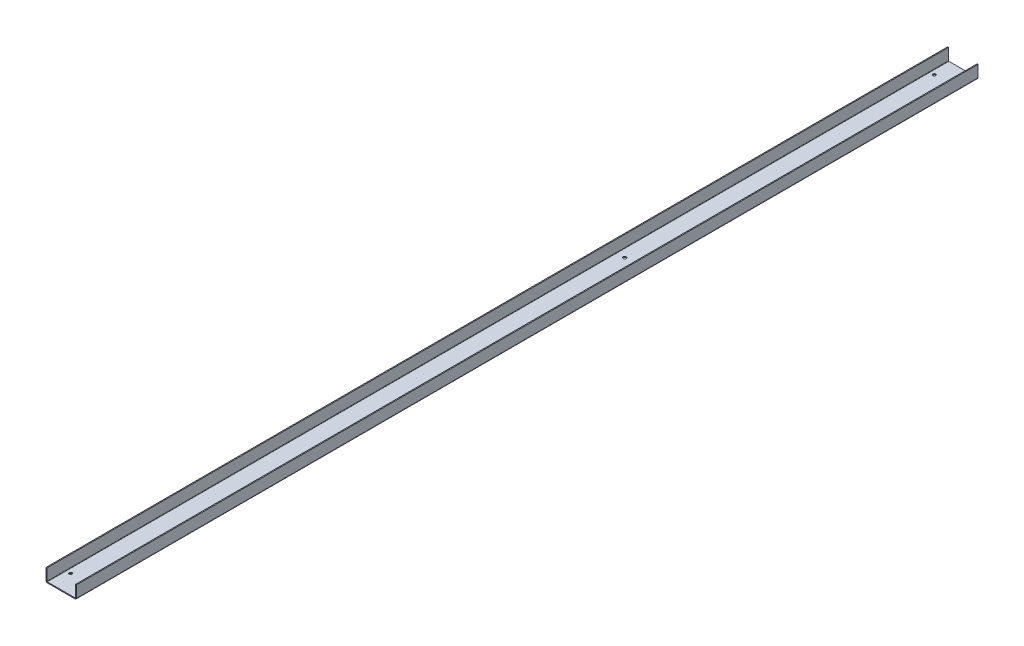
ISO-10303-21;
HEADER;
FILE_DESCRIPTION(('STEP AP214'),'2;1');
FILE_NAME('part.step','',(''),(''),'','','');
FILE_SCHEMA(('AUTOMOTIVE_DESIGN { 1 0 10303 214 1 1 1 1 }'));
ENDSEC;
DATA;
#1=APPLICATION_CONTEXT('core data for automotive mechanical design processes');
#2=APPLICATION_PROTOCOL_DEFINITION('international standard','automotive_design',2000,#1);
#3=PRODUCT_CONTEXT('',#1,'mechanical');
#4=PRODUCT('Part','Part','',(#3));
#5=PRODUCT_RELATED_PRODUCT_CATEGORY('part','',(#4));
#6=PRODUCT_DEFINITION_FORMATION('','',#4);
#7=PRODUCT_DEFINITION_CONTEXT('part definition',#1,'design');
#8=PRODUCT_DEFINITION('design','',#6,#7);
#9=PRODUCT_DEFINITION_SHAPE('','',#8);
#10=(LENGTH_UNIT() NAMED_UNIT(*) SI_UNIT(.MILLI.,.METRE.));
#11=(NAMED_UNIT(*) PLANE_ANGLE_UNIT() SI_UNIT($,.RADIAN.));
#12=(NAMED_UNIT(*) SI_UNIT($,.STERADIAN.) SOLID_ANGLE_UNIT());
#13=UNCERTAINTY_MEASURE_WITH_UNIT(LENGTH_MEASURE(1.E-05),#10,'distance_accuracy_value','');
#14=(GEOMETRIC_REPRESENTATION_CONTEXT(3) GLOBAL_UNCERTAINTY_ASSIGNED_CONTEXT((#13)) GLOBAL_UNIT_ASSIGNED_CONTEXT((#10,
#11,#12)) REPRESENTATION_CONTEXT('',''));
#15=CARTESIAN_POINT('',(0.,0.,0.));
#16=DIRECTION('',(0.,0.,1.));
#17=DIRECTION('',(1.,0.,0.));
#18=AXIS2_PLACEMENT_3D('',#15,#16,#17);
#19=CARTESIAN_POINT('',(-29.2634,0.,950.));
#20=DIRECTION('',(0.,0.,1.));
#21=DIRECTION('',(1.,0.,0.));
#22=AXIS2_PLACEMENT_3D('',#19,#20,#21);
#23=PLANE('',#22);
#24=DIRECTION('',(0.,-1.,0.));
#25=VECTOR('',#24,1.);
#26=CARTESIAN_POINT('',(-29.2634,0.,950.));
#27=LINE('',#26,#25);
#28=CARTESIAN_POINT('',(-29.2634,0.,950.));
#29=VERTEX_POINT('',#28);
#30=CARTESIAN_POINT('',(-29.2634,-2.,950.));
#31=VERTEX_POINT('',#30);
#32=EDGE_CURVE('E11',#29,#31,#27,.T.);
#33=ORIENTED_EDGE('',*,*,#32,.F.);
#34=CARTESIAN_POINT('',(-29.2634,0.7366,950.));
#35=DIRECTION('',(0.,0.,-1.));
#36=DIRECTION('',(-1.,0.,0.));
#37=AXIS2_PLACEMENT_3D('',#34,#35,#36);
#38=CIRCLE('',#37,0.7366);
#39=CARTESIAN_POINT('',(-30.,0.7366,950.));
#40=VERTEX_POINT('',#39);
#41=EDGE_CURVE('E252',#40,#29,#38,.F.);
#42=ORIENTED_EDGE('',*,*,#41,.F.);
#43=DIRECTION('',(1.,0.,0.));
#44=VECTOR('',#43,1.);
#45=CARTESIAN_POINT('',(-32.,0.736600000000001,950.));
#46=LINE('',#45,#44);
#47=CARTESIAN_POINT('',(-32.,0.736600000000001,950.));
#48=VERTEX_POINT('',#47);
#49=EDGE_CURVE('E49',#48,#40,#46,.T.);
#50=ORIENTED_EDGE('',*,*,#49,.F.);
#51=CARTESIAN_POINT('',(-29.2634,0.7366,950.));
#52=DIRECTION('',(0.,0.,1.));
#53=DIRECTION('',(1.,0.,0.));
#54=AXIS2_PLACEMENT_3D('',#51,#52,#53);
#55=CIRCLE('',#54,2.7366);
#56=EDGE_CURVE('E150',#48,#31,#55,.T.);
#57=ORIENTED_EDGE('',*,*,#56,.T.);
#58=EDGE_LOOP('',(#33,#42,#50,#57));
#59=FACE_BOUND('',#58,.T.);
#60=ADVANCED_FACE('F41',(#59),#23,.T.);
#61=CARTESIAN_POINT('',(-32.,0.736600000000001,950.));
#62=DIRECTION('',(0.,0.,1.));
#63=DIRECTION('',(1.,0.,0.));
#64=AXIS2_PLACEMENT_3D('',#61,#62,#63);
#65=PLANE('',#64);
#66=DIRECTION('',(1.,0.,0.));
#67=VECTOR('',#66,1.);
#68=CARTESIAN_POINT('',(-30.,0.,950.));
#69=LINE('',#68,#67);
#70=CARTESIAN_POINT('',(29.2634,0.,950.));
#71=VERTEX_POINT('',#70);
#72=EDGE_CURVE('E144',#29,#71,#69,.T.);
#73=ORIENTED_EDGE('',*,*,#72,.F.);
#74=ORIENTED_EDGE('',*,*,#32,.T.);
#75=DIRECTION('',(1.,0.,0.));
#76=VECTOR('',#75,1.);
#77=CARTESIAN_POINT('',(-30.,-2.,950.));
#78=LINE('',#77,#76);
#79=CARTESIAN_POINT('',(29.2634,-1.99999999999999,950.));
#80=VERTEX_POINT('',#79);
#81=EDGE_CURVE('E141',#31,#80,#78,.T.);
#82=ORIENTED_EDGE('',*,*,#81,.T.);
#83=DIRECTION('',(0.,1.,0.));
#84=VECTOR('',#83,1.);
#85=CARTESIAN_POINT('',(29.2634,-1.99999999999999,950.));
#86=LINE('',#85,#84);
#87=EDGE_CURVE('E233',#80,#71,#86,.T.);
#88=ORIENTED_EDGE('',*,*,#87,.T.);
#89=EDGE_LOOP('',(#73,#74,#82,#88));
#90=FACE_BOUND('',#89,.T.);
#91=ADVANCED_FACE('F139',(#90),#65,.T.);
#92=CARTESIAN_POINT('',(-30.,0.7366,-950.));
#93=DIRECTION('',(0.,0.,-1.));
#94=DIRECTION('',(-1.,0.,0.));
#95=AXIS2_PLACEMENT_3D('',#92,#93,#94);
#96=PLANE('',#95);
#97=DIRECTION('',(-1.,0.,0.));
#98=VECTOR('',#97,1.);
#99=CARTESIAN_POINT('',(-30.,0.7366,-950.));
#100=LINE('',#99,#98);
#101=CARTESIAN_POINT('',(-30.,0.7366,-950.));
#102=VERTEX_POINT('',#101);
#103=CARTESIAN_POINT('',(-32.,0.736600000000001,-950.));
#104=VERTEX_POINT('',#103);
#105=EDGE_CURVE('E238',#102,#104,#100,.T.);
#106=ORIENTED_EDGE('',*,*,#105,.F.);
#107=CARTESIAN_POINT('',(-29.2634,0.7366,-950.));
#108=DIRECTION('',(0.,0.,-1.));
#109=DIRECTION('',(-1.,0.,0.));
#110=AXIS2_PLACEMENT_3D('',#107,#108,#109);
#111=CIRCLE('',#110,0.7366);
#112=CARTESIAN_POINT('',(-29.2634,0.,-950.));
#113=VERTEX_POINT('',#112);
#114=EDGE_CURVE('E190',#102,#113,#111,.F.);
#115=ORIENTED_EDGE('',*,*,#114,.T.);
#116=DIRECTION('',(0.,1.,0.));
#117=VECTOR('',#116,1.);
#118=CARTESIAN_POINT('',(-29.2634,-2.,-950.));
#119=LINE('',#118,#117);
#120=CARTESIAN_POINT('',(-29.2634,-2.,-950.));
#121=VERTEX_POINT('',#120);
#122=EDGE_CURVE('E236',#121,#113,#119,.T.);
#123=ORIENTED_EDGE('',*,*,#122,.F.);
#124=CARTESIAN_POINT('',(-29.2634,0.7366,-950.));
#125=DIRECTION('',(0.,0.,1.));
#126=DIRECTION('',(1.,0.,0.));
#127=AXIS2_PLACEMENT_3D('',#124,#125,#126);
#128=CIRCLE('',#127,2.7366);
#129=EDGE_CURVE('E162',#104,#121,#128,.T.);
#130=ORIENTED_EDGE('',*,*,#129,.F.);
#131=EDGE_LOOP('',(#106,#115,#123,#130));
#132=FACE_BOUND('',#131,.T.);
#133=ADVANCED_FACE('F329',(#132),#96,.T.);
#134=CARTESIAN_POINT('',(-29.2634,-2.,-950.));
#135=DIRECTION('',(0.,0.,-1.));
#136=DIRECTION('',(-1.,0.,0.));
#137=AXIS2_PLACEMENT_3D('',#134,#135,#136);
#138=PLANE('',#137);
#139=DIRECTION('',(0.,-1.,0.));
#140=VECTOR('',#139,1.);
#141=CARTESIAN_POINT('',(-30.,25.,-950.));
#142=LINE('',#141,#140);
#143=CARTESIAN_POINT('',(-30.,25.,-950.));
#144=VERTEX_POINT('',#143);
#145=EDGE_CURVE('E193',#144,#102,#142,.T.);
#146=ORIENTED_EDGE('',*,*,#145,.T.);
#147=ORIENTED_EDGE('',*,*,#105,.T.);
#148=DIRECTION('',(0.,1.,0.));
#149=VECTOR('',#148,1.);
#150=CARTESIAN_POINT('',(-32.,25.,-950.));
#151=LINE('',#150,#149);
#152=CARTESIAN_POINT('',(-32.,25.,-950.));
#153=VERTEX_POINT('',#152);
#154=EDGE_CURVE('E199',#153,#104,#151,.F.);
#155=ORIENTED_EDGE('',*,*,#154,.F.);
#156=DIRECTION('',(1.,0.,0.));
#157=VECTOR('',#156,1.);
#158=CARTESIAN_POINT('',(-32.,25.,-950.));
#159=LINE('',#158,#157);
#160=EDGE_CURVE('E196',#153,#144,#159,.T.);
#161=ORIENTED_EDGE('',*,*,#160,.T.);
#162=EDGE_LOOP('',(#146,#147,#155,#161));
#163=FACE_BOUND('',#162,.T.);
#164=ADVANCED_FACE('F332',(#163),#138,.T.);
#165=CARTESIAN_POINT('',(30.,0.736600000000007,950.));
#166=DIRECTION('',(0.,0.,1.));
#167=DIRECTION('',(1.,0.,0.));
#168=AXIS2_PLACEMENT_3D('',#165,#166,#167);
#169=PLANE('',#168);
#170=DIRECTION('',(1.,0.,0.));
#171=VECTOR('',#170,1.);
#172=CARTESIAN_POINT('',(30.,0.736600000000007,950.));
#173=LINE('',#172,#171);
#174=CARTESIAN_POINT('',(30.,0.736600000000007,950.));
#175=VERTEX_POINT('',#174);
#176=CARTESIAN_POINT('',(32.,0.736600000000008,950.));
#177=VERTEX_POINT('',#176);
#178=EDGE_CURVE('E57',#175,#177,#173,.T.);
#179=ORIENTED_EDGE('',*,*,#178,.F.);
#180=CARTESIAN_POINT('',(29.2634,0.736600000000007,950.));
#181=DIRECTION('',(0.,0.,-1.));
#182=DIRECTION('',(-1.,0.,0.));
#183=AXIS2_PLACEMENT_3D('',#180,#181,#182);
#184=CIRCLE('',#183,0.7366);
#185=EDGE_CURVE('E262',#71,#175,#184,.F.);
#186=ORIENTED_EDGE('',*,*,#185,.F.);
#187=ORIENTED_EDGE('',*,*,#87,.F.);
#188=CARTESIAN_POINT('',(29.2634,0.736600000000007,950.));
#189=DIRECTION('',(0.,0.,1.));
#190=DIRECTION('',(1.,0.,0.));
#191=AXIS2_PLACEMENT_3D('',#188,#189,#190);
#192=CIRCLE('',#191,2.7366);
#193=EDGE_CURVE('E170',#80,#177,#192,.T.);
#194=ORIENTED_EDGE('',*,*,#193,.T.);
#195=EDGE_LOOP('',(#179,#186,#187,#194));
#196=FACE_BOUND('',#195,.T.);
#197=ADVANCED_FACE('F357',(#196),#169,.T.);
#198=CARTESIAN_POINT('',(29.2634,-1.99999999999999,950.));
#199=DIRECTION('',(0.,0.,1.));
#200=DIRECTION('',(1.,0.,0.));
#201=AXIS2_PLACEMENT_3D('',#198,#199,#200);
#202=PLANE('',#201);
#203=DIRECTION('',(0.,1.,0.));
#204=VECTOR('',#203,1.);
#205=CARTESIAN_POINT('',(30.,0.,950.));
#206=LINE('',#205,#204);
#207=CARTESIAN_POINT('',(30.,25.,950.));
#208=VERTEX_POINT('',#207);
#209=EDGE_CURVE('E265',#175,#208,#206,.T.);
#210=ORIENTED_EDGE('',*,*,#209,.F.);
#211=ORIENTED_EDGE('',*,*,#178,.T.);
#212=DIRECTION('',(0.,1.,0.));
#213=VECTOR('',#212,1.);
#214=CARTESIAN_POINT('',(32.,0.,950.));
#215=LINE('',#214,#213);
#216=CARTESIAN_POINT('',(32.,25.,950.));
#217=VERTEX_POINT('',#216);
#218=EDGE_CURVE('E111',#177,#217,#215,.T.);
#219=ORIENTED_EDGE('',*,*,#218,.T.);
#220=DIRECTION('',(1.,0.,0.));
#221=VECTOR('',#220,1.);
#222=CARTESIAN_POINT('',(30.,25.,950.));
#223=LINE('',#222,#221);
#224=EDGE_CURVE('E268',#208,#217,#223,.T.);
#225=ORIENTED_EDGE('',*,*,#224,.F.);
#226=EDGE_LOOP('',(#210,#211,#219,#225));
#227=FACE_BOUND('',#226,.T.);
#228=ADVANCED_FACE('F360',(#227),#202,.T.);
#229=CARTESIAN_POINT('',(29.2634,0.,-950.));
#230=DIRECTION('',(0.,0.,-1.));
#231=DIRECTION('',(-1.,0.,0.));
#232=AXIS2_PLACEMENT_3D('',#229,#230,#231);
#233=PLANE('',#232);
#234=DIRECTION('',(0.,-1.,0.));
#235=VECTOR('',#234,1.);
#236=CARTESIAN_POINT('',(29.2634,0.,-950.));
#237=LINE('',#236,#235);
#238=CARTESIAN_POINT('',(29.2634,0.,-950.));
#239=VERTEX_POINT('',#238);
#240=CARTESIAN_POINT('',(29.2634,-1.99999999999999,-950.));
#241=VERTEX_POINT('',#240);
#242=EDGE_CURVE('E98',#239,#241,#237,.T.);
#243=ORIENTED_EDGE('',*,*,#242,.F.);
#244=CARTESIAN_POINT('',(29.2634,0.736600000000007,-950.));
#245=DIRECTION('',(0.,0.,-1.));
#246=DIRECTION('',(-1.,0.,0.));
#247=AXIS2_PLACEMENT_3D('',#244,#245,#246);
#248=CIRCLE('',#247,0.7366);
#249=CARTESIAN_POINT('',(30.,0.736600000000007,-950.));
#250=VERTEX_POINT('',#249);
#251=EDGE_CURVE('E186',#239,#250,#248,.F.);
#252=ORIENTED_EDGE('',*,*,#251,.T.);
#253=DIRECTION('',(-1.,0.,0.));
#254=VECTOR('',#253,1.);
#255=CARTESIAN_POINT('',(32.,0.736600000000008,-950.));
#256=LINE('',#255,#254);
#257=CARTESIAN_POINT('',(32.,0.736600000000008,-950.));
#258=VERTEX_POINT('',#257);
#259=EDGE_CURVE('E105',#258,#250,#256,.T.);
#260=ORIENTED_EDGE('',*,*,#259,.F.);
#261=CARTESIAN_POINT('',(29.2634,0.736600000000007,-950.));
#262=DIRECTION('',(0.,0.,1.));
#263=DIRECTION('',(1.,0.,0.));
#264=AXIS2_PLACEMENT_3D('',#261,#262,#263);
#265=CIRCLE('',#264,2.7366);
#266=EDGE_CURVE('E205',#241,#258,#265,.T.);
#267=ORIENTED_EDGE('',*,*,#266,.F.);
#268=EDGE_LOOP('',(#243,#252,#260,#267));
#269=FACE_BOUND('',#268,.T.);
#270=ADVANCED_FACE('F364',(#269),#233,.T.);
#271=CARTESIAN_POINT('',(32.,0.736600000000008,-950.));
#272=DIRECTION('',(0.,0.,-1.));
#273=DIRECTION('',(-1.,0.,0.));
#274=AXIS2_PLACEMENT_3D('',#271,#272,#273);
#275=PLANE('',#274);
#276=DIRECTION('',(1.,0.,0.));
#277=VECTOR('',#276,1.);
#278=CARTESIAN_POINT('',(-30.,0.,-950.));
#279=LINE('',#278,#277);
#280=EDGE_CURVE('E188',#113,#239,#279,.T.);
#281=ORIENTED_EDGE('',*,*,#280,.T.);
#282=ORIENTED_EDGE('',*,*,#242,.T.);
#283=DIRECTION('',(1.,0.,0.));
#284=VECTOR('',#283,1.);
#285=CARTESIAN_POINT('',(-30.,-2.,-950.));
#286=LINE('',#285,#284);
#287=EDGE_CURVE('E203',#121,#241,#286,.T.);
#288=ORIENTED_EDGE('',*,*,#287,.F.);
#289=ORIENTED_EDGE('',*,*,#122,.T.);
#290=EDGE_LOOP('',(#281,#282,#288,#289));
#291=FACE_BOUND('',#290,.T.);
#292=ADVANCED_FACE('F367',(#291),#275,.T.);
#293=CARTESIAN_POINT('',(32.,0.,950.));
#294=DIRECTION('',(-1.,0.,0.));
#295=DIRECTION('',(0.,-1.,0.));
#296=AXIS2_PLACEMENT_3D('',#293,#294,#295);
#297=PLANE('',#296);
#298=DIRECTION('',(0.,1.,0.));
#299=VECTOR('',#298,1.);
#300=CARTESIAN_POINT('',(32.,0.,-950.));
#301=LINE('',#300,#299);
#302=CARTESIAN_POINT('',(32.,25.,-950.));
#303=VERTEX_POINT('',#302);
#304=EDGE_CURVE('E176',#258,#303,#301,.T.);
#305=ORIENTED_EDGE('',*,*,#304,.T.);
#306=DIRECTION('',(0.,0.,-1.));
#307=VECTOR('',#306,1.);
#308=CARTESIAN_POINT('',(32.,25.,950.));
#309=LINE('',#308,#307);
#310=EDGE_CURVE('E229',#217,#303,#309,.T.);
#311=ORIENTED_EDGE('',*,*,#310,.F.);
#312=ORIENTED_EDGE('',*,*,#218,.F.);
#313=DIRECTION('',(0.,0.,-1.));
#314=VECTOR('',#313,1.);
#315=CARTESIAN_POINT('',(32.,0.736600000000008,950.));
#316=LINE('',#315,#314);
#317=EDGE_CURVE('E172',#177,#258,#316,.T.);
#318=ORIENTED_EDGE('',*,*,#317,.T.);
#319=EDGE_LOOP('',(#305,#311,#312,#318));
#320=FACE_BOUND('',#319,.T.);
#321=ADVANCED_FACE('F370',(#320),#297,.F.);
#322=CARTESIAN_POINT('',(30.,25.,950.));
#323=DIRECTION('',(0.,1.,0.));
#324=DIRECTION('',(0.,0.,1.));
#325=AXIS2_PLACEMENT_3D('',#322,#323,#324);
#326=PLANE('',#325);
#327=DIRECTION('',(1.,0.,0.));
#328=VECTOR('',#327,1.);
#329=CARTESIAN_POINT('',(30.,25.,-950.));
#330=LINE('',#329,#328);
#331=CARTESIAN_POINT('',(30.,25.,-950.));
#332=VERTEX_POINT('',#331);
#333=EDGE_CURVE('E179',#332,#303,#330,.T.);
#334=ORIENTED_EDGE('',*,*,#333,.F.);
#335=DIRECTION('',(0.,0.,-1.));
#336=VECTOR('',#335,1.);
#337=CARTESIAN_POINT('',(30.,25.,950.));
#338=LINE('',#337,#336);
#339=EDGE_CURVE('E227',#208,#332,#338,.T.);
#340=ORIENTED_EDGE('',*,*,#339,.F.);
#341=ORIENTED_EDGE('',*,*,#224,.T.);
#342=ORIENTED_EDGE('',*,*,#310,.T.);
#343=EDGE_LOOP('',(#334,#340,#341,#342));
#344=FACE_BOUND('',#343,.T.);
#345=ADVANCED_FACE('F373',(#344),#326,.T.);
#346=CARTESIAN_POINT('',(30.,0.,950.));
#347=DIRECTION('',(-1.,0.,0.));
#348=DIRECTION('',(0.,-1.,0.));
#349=AXIS2_PLACEMENT_3D('',#346,#347,#348);
#350=PLANE('',#349);
#351=DIRECTION('',(0.,1.,0.));
#352=VECTOR('',#351,1.);
#353=CARTESIAN_POINT('',(30.,0.,-950.));
#354=LINE('',#353,#352);
#355=EDGE_CURVE('E183',#250,#332,#354,.T.);
#356=ORIENTED_EDGE('',*,*,#355,.F.);
#357=DIRECTION('',(0.,0.,-1.));
#358=VECTOR('',#357,1.);
#359=CARTESIAN_POINT('',(30.,0.736600000000007,950.));
#360=LINE('',#359,#358);
#361=EDGE_CURVE('E224',#175,#250,#360,.T.);
#362=ORIENTED_EDGE('',*,*,#361,.F.);
#363=ORIENTED_EDGE('',*,*,#209,.T.);
#364=ORIENTED_EDGE('',*,*,#339,.T.);
#365=EDGE_LOOP('',(#356,#362,#363,#364));
#366=FACE_BOUND('',#365,.T.);
#367=ADVANCED_FACE('F377',(#366),#350,.T.);
#368=CARTESIAN_POINT('',(29.2634,0.736600000000007,950.));
#369=DIRECTION('',(0.,0.,-1.));
#370=DIRECTION('',(-1.,0.,0.));
#371=AXIS2_PLACEMENT_3D('',#368,#369,#370);
#372=CYLINDRICAL_SURFACE('',#371,0.7366);
#373=ORIENTED_EDGE('',*,*,#251,.F.);
#374=DIRECTION('',(0.,0.,-1.));
#375=VECTOR('',#374,1.);
#376=CARTESIAN_POINT('',(29.2634,0.,950.));
#377=LINE('',#376,#375);
#378=EDGE_CURVE('E221',#71,#239,#377,.T.);
#379=ORIENTED_EDGE('',*,*,#378,.F.);
#380=ORIENTED_EDGE('',*,*,#185,.T.);
#381=ORIENTED_EDGE('',*,*,#361,.T.);
#382=EDGE_LOOP('',(#373,#379,#380,#381));
#383=FACE_BOUND('',#382,.T.);
#384=ADVANCED_FACE('F313',(#383),#372,.F.);
#385=CARTESIAN_POINT('',(-30.,0.,950.));
#386=DIRECTION('',(0.,1.,0.));
#387=DIRECTION('',(-1.,0.,0.));
#388=AXIS2_PLACEMENT_3D('',#385,#386,#387);
#389=PLANE('',#388);
#390=CARTESIAN_POINT('',(-12.5,0.,-250.));
#391=DIRECTION('',(0.,1.,0.));
#392=DIRECTION('',(0.,0.,1.));
#393=AXIS2_PLACEMENT_3D('',#390,#391,#392);
#394=CIRCLE('',#393,3.25);
#395=CARTESIAN_POINT('',(-12.5,0.,-246.75));
#396=VERTEX_POINT('',#395);
#397=EDGE_CURVE('E304',#396,#396,#394,.T.);
#398=ORIENTED_EDGE('',*,*,#397,.F.);
#399=EDGE_LOOP('',(#398));
#400=FACE_BOUND('',#399,.T.);
#401=CARTESIAN_POINT('',(12.5,0.,-250.));
#402=DIRECTION('',(0.,1.,0.));
#403=DIRECTION('',(0.,0.,1.));
#404=AXIS2_PLACEMENT_3D('',#401,#402,#403);
#405=CIRCLE('',#404,3.25);
#406=CARTESIAN_POINT('',(12.5,0.,-246.75));
#407=VERTEX_POINT('',#406);
#408=EDGE_CURVE('E298',#407,#407,#405,.T.);
#409=ORIENTED_EDGE('',*,*,#408,.F.);
#410=EDGE_LOOP('',(#409));
#411=FACE_BOUND('',#410,.T.);
#412=CARTESIAN_POINT('',(-20.,0.,-910.));
#413=DIRECTION('',(0.,1.,0.));
#414=DIRECTION('',(0.,0.,1.));
#415=AXIS2_PLACEMENT_3D('',#412,#413,#414);
#416=CIRCLE('',#415,3.);
#417=CARTESIAN_POINT('',(-20.,0.,-907.));
#418=VERTEX_POINT('',#417);
#419=EDGE_CURVE('E292',#418,#418,#416,.T.);
#420=ORIENTED_EDGE('',*,*,#419,.F.);
#421=EDGE_LOOP('',(#420));
#422=FACE_BOUND('',#421,.T.);
#423=CARTESIAN_POINT('',(20.,0.,-910.));
#424=DIRECTION('',(0.,1.,0.));
#425=DIRECTION('',(0.,0.,1.));
#426=AXIS2_PLACEMENT_3D('',#423,#424,#425);
#427=CIRCLE('',#426,3.);
#428=CARTESIAN_POINT('',(20.,0.,-907.));
#429=VERTEX_POINT('',#428);
#430=EDGE_CURVE('E286',#429,#429,#427,.T.);
#431=ORIENTED_EDGE('',*,*,#430,.F.);
#432=EDGE_LOOP('',(#431));
#433=FACE_BOUND('',#432,.T.);
#434=CARTESIAN_POINT('',(-20.,0.,910.));
#435=DIRECTION('',(0.,1.,0.));
#436=DIRECTION('',(0.,0.,1.));
#437=AXIS2_PLACEMENT_3D('',#434,#435,#436);
#438=CIRCLE('',#437,3.);
#439=CARTESIAN_POINT('',(-20.,0.,913.));
#440=VERTEX_POINT('',#439);
#441=EDGE_CURVE('E280',#440,#440,#438,.T.);
#442=ORIENTED_EDGE('',*,*,#441,.F.);
#443=EDGE_LOOP('',(#442));
#444=FACE_BOUND('',#443,.T.);
#445=CARTESIAN_POINT('',(20.,0.,910.));
#446=DIRECTION('',(0.,1.,0.));
#447=DIRECTION('',(0.,0.,1.));
#448=AXIS2_PLACEMENT_3D('',#445,#446,#447);
#449=CIRCLE('',#448,3.);
#450=CARTESIAN_POINT('',(20.,0.,913.));
#451=VERTEX_POINT('',#450);
#452=EDGE_CURVE('E274',#451,#451,#449,.T.);
#453=ORIENTED_EDGE('',*,*,#452,.F.);
#454=EDGE_LOOP('',(#453));
#455=FACE_BOUND('',#454,.T.);
#456=ORIENTED_EDGE('',*,*,#280,.F.);
#457=DIRECTION('',(0.,0.,-1.));
#458=VECTOR('',#457,1.);
#459=CARTESIAN_POINT('',(-29.2634,0.,950.));
#460=LINE('',#459,#458);
#461=EDGE_CURVE('E218',#29,#113,#460,.T.);
#462=ORIENTED_EDGE('',*,*,#461,.F.);
#463=ORIENTED_EDGE('',*,*,#72,.T.);
#464=ORIENTED_EDGE('',*,*,#378,.T.);
#465=EDGE_LOOP('',(#456,#462,#463,#464));
#466=FACE_BOUND('',#465,.T.);
#467=ADVANCED_FACE('F310',(#400,#411,#422,#433,#444,#455,#466),#389,.T.);
#468=CARTESIAN_POINT('',(-29.2634,0.7366,950.));
#469=DIRECTION('',(0.,0.,-1.));
#470=DIRECTION('',(-1.,0.,0.));
#471=AXIS2_PLACEMENT_3D('',#468,#469,#470);
#472=CYLINDRICAL_SURFACE('',#471,0.7366);
#473=ORIENTED_EDGE('',*,*,#114,.F.);
#474=DIRECTION('',(0.,0.,-1.));
#475=VECTOR('',#474,1.);
#476=CARTESIAN_POINT('',(-30.,0.7366,950.));
#477=LINE('',#476,#475);
#478=EDGE_CURVE('E215',#40,#102,#477,.T.);
#479=ORIENTED_EDGE('',*,*,#478,.F.);
#480=ORIENTED_EDGE('',*,*,#41,.T.);
#481=ORIENTED_EDGE('',*,*,#461,.T.);
#482=EDGE_LOOP('',(#473,#479,#480,#481));
#483=FACE_BOUND('',#482,.T.);
#484=ADVANCED_FACE('F251',(#483),#472,.F.);
#485=CARTESIAN_POINT('',(-30.,25.,950.));
#486=DIRECTION('',(1.,0.,0.));
#487=DIRECTION('',(0.,0.,-1.));
#488=AXIS2_PLACEMENT_3D('',#485,#486,#487);
#489=PLANE('',#488);
#490=ORIENTED_EDGE('',*,*,#145,.F.);
#491=DIRECTION('',(0.,0.,-1.));
#492=VECTOR('',#491,1.);
#493=CARTESIAN_POINT('',(-30.,25.,950.));
#494=LINE('',#493,#492);
#495=CARTESIAN_POINT('',(-30.,25.,950.));
#496=VERTEX_POINT('',#495);
#497=EDGE_CURVE('E213',#496,#144,#494,.T.);
#498=ORIENTED_EDGE('',*,*,#497,.F.);
#499=DIRECTION('',(0.,-1.,0.));
#500=VECTOR('',#499,1.);
#501=CARTESIAN_POINT('',(-30.,25.,950.));
#502=LINE('',#501,#500);
#503=EDGE_CURVE('E245',#496,#40,#502,.T.);
#504=ORIENTED_EDGE('',*,*,#503,.T.);
#505=ORIENTED_EDGE('',*,*,#478,.T.);
#506=EDGE_LOOP('',(#490,#498,#504,#505));
#507=FACE_BOUND('',#506,.T.);
#508=ADVANCED_FACE('F256',(#507),#489,.T.);
#509=CARTESIAN_POINT('',(-32.,25.,950.));
#510=DIRECTION('',(0.,1.,0.));
#511=DIRECTION('',(0.,0.,1.));
#512=AXIS2_PLACEMENT_3D('',#509,#510,#511);
#513=PLANE('',#512);
#514=ORIENTED_EDGE('',*,*,#160,.F.);
#515=DIRECTION('',(0.,0.,-1.));
#516=VECTOR('',#515,1.);
#517=CARTESIAN_POINT('',(-32.,25.,950.));
#518=LINE('',#517,#516);
#519=CARTESIAN_POINT('',(-32.,25.,950.));
#520=VERTEX_POINT('',#519);
#521=EDGE_CURVE('E211',#520,#153,#518,.T.);
#522=ORIENTED_EDGE('',*,*,#521,.F.);
#523=DIRECTION('',(1.,0.,0.));
#524=VECTOR('',#523,1.);
#525=CARTESIAN_POINT('',(-32.,25.,950.));
#526=LINE('',#525,#524);
#527=EDGE_CURVE('E257',#520,#496,#526,.T.);
#528=ORIENTED_EDGE('',*,*,#527,.T.);
#529=ORIENTED_EDGE('',*,*,#497,.T.);
#530=EDGE_LOOP('',(#514,#522,#528,#529));
#531=FACE_BOUND('',#530,.T.);
#532=ADVANCED_FACE('F337',(#531),#513,.T.);
#533=CARTESIAN_POINT('',(-32.,25.,950.));
#534=DIRECTION('',(1.,0.,0.));
#535=DIRECTION('',(0.,0.,-1.));
#536=AXIS2_PLACEMENT_3D('',#533,#534,#535);
#537=PLANE('',#536);
#538=ORIENTED_EDGE('',*,*,#154,.T.);
#539=DIRECTION('',(0.,0.,-1.));
#540=VECTOR('',#539,1.);
#541=CARTESIAN_POINT('',(-32.,0.736600000000001,950.));
#542=LINE('',#541,#540);
#543=EDGE_CURVE('E164',#48,#104,#542,.T.);
#544=ORIENTED_EDGE('',*,*,#543,.F.);
#545=DIRECTION('',(0.,1.,0.));
#546=VECTOR('',#545,1.);
#547=CARTESIAN_POINT('',(-32.,25.,950.));
#548=LINE('',#547,#546);
#549=EDGE_CURVE('E155',#520,#48,#548,.F.);
#550=ORIENTED_EDGE('',*,*,#549,.F.);
#551=ORIENTED_EDGE('',*,*,#521,.T.);
#552=EDGE_LOOP('',(#538,#544,#550,#551));
#553=FACE_BOUND('',#552,.T.);
#554=ADVANCED_FACE('F335',(#553),#537,.F.);
#555=CARTESIAN_POINT('',(-29.2634,0.7366,950.));
#556=DIRECTION('',(0.,0.,-1.));
#557=DIRECTION('',(-1.,0.,0.));
#558=AXIS2_PLACEMENT_3D('',#555,#556,#557);
#559=CYLINDRICAL_SURFACE('',#558,2.7366);
#560=ORIENTED_EDGE('',*,*,#129,.T.);
#561=DIRECTION('',(0.,0.,-1.));
#562=VECTOR('',#561,1.);
#563=CARTESIAN_POINT('',(-29.2634,-2.,950.));
#564=LINE('',#563,#562);
#565=EDGE_CURVE('E159',#31,#121,#564,.T.);
#566=ORIENTED_EDGE('',*,*,#565,.F.);
#567=ORIENTED_EDGE('',*,*,#56,.F.);
#568=ORIENTED_EDGE('',*,*,#543,.T.);
#569=EDGE_LOOP('',(#560,#566,#567,#568));
#570=FACE_BOUND('',#569,.T.);
#571=ADVANCED_FACE('F160',(#570),#559,.T.);
#572=CARTESIAN_POINT('',(-30.,-2.,950.));
#573=DIRECTION('',(0.,1.,0.));
#574=DIRECTION('',(-1.,0.,0.));
#575=AXIS2_PLACEMENT_3D('',#572,#573,#574);
#576=PLANE('',#575);
#577=CARTESIAN_POINT('',(-12.5,-2.00000000000001,-250.));
#578=DIRECTION('',(0.,1.,0.));
#579=DIRECTION('',(0.,0.,1.));
#580=AXIS2_PLACEMENT_3D('',#577,#578,#579);
#581=CIRCLE('',#580,3.25);
#582=CARTESIAN_POINT('',(-12.5,-2.00000000000001,-246.75));
#583=VERTEX_POINT('',#582);
#584=EDGE_CURVE('E301',#583,#583,#581,.T.);
#585=ORIENTED_EDGE('',*,*,#584,.T.);
#586=EDGE_LOOP('',(#585));
#587=FACE_BOUND('',#586,.T.);
#588=CARTESIAN_POINT('',(12.5,-2.,-250.));
#589=DIRECTION('',(0.,1.,0.));
#590=DIRECTION('',(0.,0.,1.));
#591=AXIS2_PLACEMENT_3D('',#588,#589,#590);
#592=CIRCLE('',#591,3.25);
#593=CARTESIAN_POINT('',(12.5,-2.,-246.75));
#594=VERTEX_POINT('',#593);
#595=EDGE_CURVE('E295',#594,#594,#592,.T.);
#596=ORIENTED_EDGE('',*,*,#595,.T.);
#597=EDGE_LOOP('',(#596));
#598=FACE_BOUND('',#597,.T.);
#599=CARTESIAN_POINT('',(-20.,-2.,-910.));
#600=DIRECTION('',(0.,1.,0.));
#601=DIRECTION('',(-1.,0.,0.));
#602=AXIS2_PLACEMENT_3D('',#599,#600,#601);
#603=CIRCLE('',#602,3.);
#604=CARTESIAN_POINT('',(-23.,-2.,-910.));
#605=VERTEX_POINT('',#604);
#606=EDGE_CURVE('E289',#605,#605,#603,.T.);
#607=ORIENTED_EDGE('',*,*,#606,.T.);
#608=EDGE_LOOP('',(#607));
#609=FACE_BOUND('',#608,.T.);
#610=CARTESIAN_POINT('',(20.,-1.99999999999999,-910.));
#611=DIRECTION('',(0.,1.,0.));
#612=DIRECTION('',(-1.,0.,0.));
#613=AXIS2_PLACEMENT_3D('',#610,#611,#612);
#614=CIRCLE('',#613,3.);
#615=CARTESIAN_POINT('',(17.,-1.99999999999999,-910.));
#616=VERTEX_POINT('',#615);
#617=EDGE_CURVE('E283',#616,#616,#614,.T.);
#618=ORIENTED_EDGE('',*,*,#617,.T.);
#619=EDGE_LOOP('',(#618));
#620=FACE_BOUND('',#619,.T.);
#621=CARTESIAN_POINT('',(-20.,-2.,910.));
#622=DIRECTION('',(0.,1.,0.));
#623=DIRECTION('',(-1.,0.,0.));
#624=AXIS2_PLACEMENT_3D('',#621,#622,#623);
#625=CIRCLE('',#624,3.);
#626=CARTESIAN_POINT('',(-23.,-2.,910.));
#627=VERTEX_POINT('',#626);
#628=EDGE_CURVE('E277',#627,#627,#625,.T.);
#629=ORIENTED_EDGE('',*,*,#628,.T.);
#630=EDGE_LOOP('',(#629));
#631=FACE_BOUND('',#630,.T.);
#632=CARTESIAN_POINT('',(20.,-1.99999999999999,910.));
#633=DIRECTION('',(0.,1.,0.));
#634=DIRECTION('',(-1.,0.,0.));
#635=AXIS2_PLACEMENT_3D('',#632,#633,#634);
#636=CIRCLE('',#635,3.);
#637=CARTESIAN_POINT('',(17.,-1.99999999999999,910.));
#638=VERTEX_POINT('',#637);
#639=EDGE_CURVE('E180',#638,#638,#636,.T.);
#640=ORIENTED_EDGE('',*,*,#639,.T.);
#641=EDGE_LOOP('',(#640));
#642=FACE_BOUND('',#641,.T.);
#643=ORIENTED_EDGE('',*,*,#287,.T.);
#644=DIRECTION('',(0.,0.,-1.));
#645=VECTOR('',#644,1.);
#646=CARTESIAN_POINT('',(29.2634,-1.99999999999999,950.));
#647=LINE('',#646,#645);
#648=EDGE_CURVE('E165',#80,#241,#647,.T.);
#649=ORIENTED_EDGE('',*,*,#648,.F.);
#650=ORIENTED_EDGE('',*,*,#81,.F.);
#651=ORIENTED_EDGE('',*,*,#565,.T.);
#652=EDGE_LOOP('',(#643,#649,#650,#651));
#653=FACE_BOUND('',#652,.T.);
#654=ADVANCED_FACE('F167',(#587,#598,#609,#620,#631,#642,#653),#576,.F.);
#655=CARTESIAN_POINT('',(29.2634,0.736600000000007,950.));
#656=DIRECTION('',(0.,0.,-1.));
#657=DIRECTION('',(-1.,0.,0.));
#658=AXIS2_PLACEMENT_3D('',#655,#656,#657);
#659=CYLINDRICAL_SURFACE('',#658,2.7366);
#660=ORIENTED_EDGE('',*,*,#266,.T.);
#661=ORIENTED_EDGE('',*,*,#317,.F.);
#662=ORIENTED_EDGE('',*,*,#193,.F.);
#663=ORIENTED_EDGE('',*,*,#648,.T.);
#664=EDGE_LOOP('',(#660,#661,#662,#663));
#665=FACE_BOUND('',#664,.T.);
#666=ADVANCED_FACE('F425',(#665),#659,.T.);
#667=CARTESIAN_POINT('',(29.2634,0.736600000000007,950.));
#668=DIRECTION('',(0.,0.,-1.));
#669=DIRECTION('',(-1.,0.,0.));
#670=AXIS2_PLACEMENT_3D('',#667,#668,#669);
#671=PLANE('',#670);
#672=ORIENTED_EDGE('',*,*,#549,.T.);
#673=ORIENTED_EDGE('',*,*,#49,.T.);
#674=ORIENTED_EDGE('',*,*,#503,.F.);
#675=ORIENTED_EDGE('',*,*,#527,.F.);
#676=EDGE_LOOP('',(#672,#673,#674,#675));
#677=FACE_BOUND('',#676,.T.);
#678=ADVANCED_FACE('F242',(#677),#671,.F.);
#679=CARTESIAN_POINT('',(29.2634,0.736600000000007,-950.));
#680=DIRECTION('',(0.,0.,-1.));
#681=DIRECTION('',(-1.,0.,0.));
#682=AXIS2_PLACEMENT_3D('',#679,#680,#681);
#683=PLANE('',#682);
#684=ORIENTED_EDGE('',*,*,#304,.F.);
#685=ORIENTED_EDGE('',*,*,#259,.T.);
#686=ORIENTED_EDGE('',*,*,#355,.T.);
#687=ORIENTED_EDGE('',*,*,#333,.T.);
#688=EDGE_LOOP('',(#684,#685,#686,#687));
#689=FACE_BOUND('',#688,.T.);
#690=ADVANCED_FACE('F440',(#689),#683,.T.);
#691=CARTESIAN_POINT('',(20.,0.,910.));
#692=DIRECTION('',(0.,1.,0.));
#693=DIRECTION('',(0.,0.,1.));
#694=AXIS2_PLACEMENT_3D('',#691,#692,#693);
#695=CYLINDRICAL_SURFACE('',#694,3.);
#696=ORIENTED_EDGE('',*,*,#452,.T.);
#697=EDGE_LOOP('',(#696));
#698=FACE_BOUND('',#697,.T.);
#699=ORIENTED_EDGE('',*,*,#639,.F.);
#700=EDGE_LOOP('',(#699));
#701=FACE_BOUND('',#700,.T.);
#702=ADVANCED_FACE('F450',(#698,#701),#695,.F.);
#703=CARTESIAN_POINT('',(-20.,0.,910.));
#704=DIRECTION('',(0.,1.,0.));
#705=DIRECTION('',(0.,0.,1.));
#706=AXIS2_PLACEMENT_3D('',#703,#704,#705);
#707=CYLINDRICAL_SURFACE('',#706,3.);
#708=ORIENTED_EDGE('',*,*,#441,.T.);
#709=EDGE_LOOP('',(#708));
#710=FACE_BOUND('',#709,.T.);
#711=ORIENTED_EDGE('',*,*,#628,.F.);
#712=EDGE_LOOP('',(#711));
#713=FACE_BOUND('',#712,.T.);
#714=ADVANCED_FACE('F461',(#710,#713),#707,.F.);
#715=CARTESIAN_POINT('',(20.,0.,-910.));
#716=DIRECTION('',(0.,1.,0.));
#717=DIRECTION('',(0.,0.,1.));
#718=AXIS2_PLACEMENT_3D('',#715,#716,#717);
#719=CYLINDRICAL_SURFACE('',#718,3.);
#720=ORIENTED_EDGE('',*,*,#430,.T.);
#721=EDGE_LOOP('',(#720));
#722=FACE_BOUND('',#721,.T.);
#723=ORIENTED_EDGE('',*,*,#617,.F.);
#724=EDGE_LOOP('',(#723));
#725=FACE_BOUND('',#724,.T.);
#726=ADVANCED_FACE('F471',(#722,#725),#719,.F.);
#727=CARTESIAN_POINT('',(-20.,0.,-910.));
#728=DIRECTION('',(0.,1.,0.));
#729=DIRECTION('',(0.,0.,1.));
#730=AXIS2_PLACEMENT_3D('',#727,#728,#729);
#731=CYLINDRICAL_SURFACE('',#730,3.);
#732=ORIENTED_EDGE('',*,*,#419,.T.);
#733=EDGE_LOOP('',(#732));
#734=FACE_BOUND('',#733,.T.);
#735=ORIENTED_EDGE('',*,*,#606,.F.);
#736=EDGE_LOOP('',(#735));
#737=FACE_BOUND('',#736,.T.);
#738=ADVANCED_FACE('F481',(#734,#737),#731,.F.);
#739=CARTESIAN_POINT('',(12.5,0.,-250.));
#740=DIRECTION('',(0.,1.,0.));
#741=DIRECTION('',(0.,0.,1.));
#742=AXIS2_PLACEMENT_3D('',#739,#740,#741);
#743=CYLINDRICAL_SURFACE('',#742,3.25);
#744=ORIENTED_EDGE('',*,*,#595,.F.);
#745=EDGE_LOOP('',(#744));
#746=FACE_BOUND('',#745,.T.);
#747=ORIENTED_EDGE('',*,*,#408,.T.);
#748=EDGE_LOOP('',(#747));
#749=FACE_BOUND('',#748,.T.);
#750=ADVANCED_FACE('F490',(#746,#749),#743,.F.);
#751=CARTESIAN_POINT('',(-12.5,0.,-250.));
#752=DIRECTION('',(0.,1.,0.));
#753=DIRECTION('',(0.,0.,1.));
#754=AXIS2_PLACEMENT_3D('',#751,#752,#753);
#755=CYLINDRICAL_SURFACE('',#754,3.25);
#756=ORIENTED_EDGE('',*,*,#584,.F.);
#757=EDGE_LOOP('',(#756));
#758=FACE_BOUND('',#757,.T.);
#759=ORIENTED_EDGE('',*,*,#397,.T.);
#760=EDGE_LOOP('',(#759));
#761=FACE_BOUND('',#760,.T.);
#762=ADVANCED_FACE('F308',(#758,#761),#755,.F.);
#763=CLOSED_SHELL('',(#60,#91,#133,#164,#197,#228,#270,#292,#321,#345,#367,#384,#467,#484,#508,
#532,#554,#571,#654,#666,#678,#690,#702,#714,#726,#738,#750,#762));
#764=MANIFOLD_SOLID_BREP('B2',#763);
#765=ADVANCED_BREP_SHAPE_REPRESENTATION('',(#18,#764),#14);
#766=SHAPE_DEFINITION_REPRESENTATION(#9,#765);
ENDSEC;
END-ISO-10303-21;
